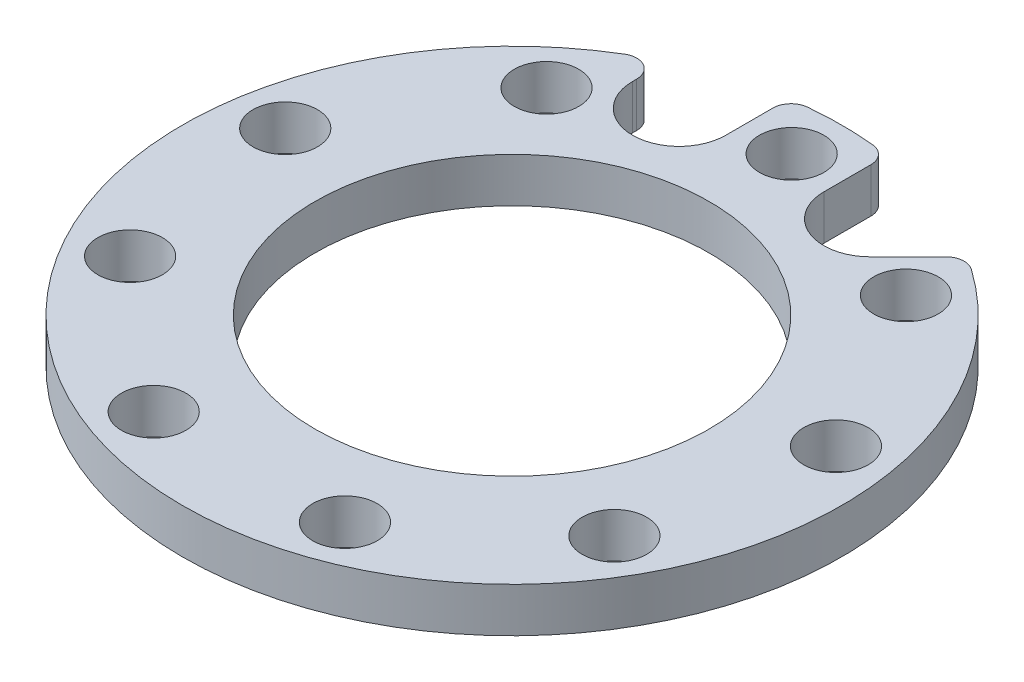
ISO-10303-21;
HEADER;
FILE_DESCRIPTION(('STEP AP214'),'2;1');
FILE_NAME('part.step','',(''),(''),'','','');
FILE_SCHEMA(('AUTOMOTIVE_DESIGN { 1 0 10303 214 1 1 1 1 }'));
ENDSEC;
DATA;
#1=APPLICATION_CONTEXT('core data for automotive mechanical design processes');
#2=APPLICATION_PROTOCOL_DEFINITION('international standard','automotive_design',2000,#1);
#3=PRODUCT_CONTEXT('',#1,'mechanical');
#4=PRODUCT('Part','Part','',(#3));
#5=PRODUCT_RELATED_PRODUCT_CATEGORY('part','',(#4));
#6=PRODUCT_DEFINITION_FORMATION('','',#4);
#7=PRODUCT_DEFINITION_CONTEXT('part definition',#1,'design');
#8=PRODUCT_DEFINITION('design','',#6,#7);
#9=PRODUCT_DEFINITION_SHAPE('','',#8);
#10=(LENGTH_UNIT() NAMED_UNIT(*) SI_UNIT(.MILLI.,.METRE.));
#11=(NAMED_UNIT(*) PLANE_ANGLE_UNIT() SI_UNIT($,.RADIAN.));
#12=(NAMED_UNIT(*) SI_UNIT($,.STERADIAN.) SOLID_ANGLE_UNIT());
#13=UNCERTAINTY_MEASURE_WITH_UNIT(LENGTH_MEASURE(1.E-05),#10,'distance_accuracy_value','');
#14=(GEOMETRIC_REPRESENTATION_CONTEXT(3) GLOBAL_UNCERTAINTY_ASSIGNED_CONTEXT((#13)) GLOBAL_UNIT_ASSIGNED_CONTEXT((#10,
#11,#12)) REPRESENTATION_CONTEXT('',''));
#15=CARTESIAN_POINT('',(0.,0.,0.));
#16=DIRECTION('',(0.,0.,1.));
#17=DIRECTION('',(1.,0.,0.));
#18=AXIS2_PLACEMENT_3D('',#15,#16,#17);
#19=CARTESIAN_POINT('',(0.,6.21400078,0.));
#20=DIRECTION('',(0.,-1.,0.));
#21=DIRECTION('',(0.,0.,-1.));
#22=AXIS2_PLACEMENT_3D('',#19,#20,#21);
#23=CYLINDRICAL_SURFACE('',#22,45.974);
#24=CARTESIAN_POINT('',(0.,6.21400078,0.));
#25=DIRECTION('',(0.,1.,0.));
#26=DIRECTION('',(0.,0.,1.));
#27=AXIS2_PLACEMENT_3D('',#24,#25,#26);
#28=CIRCLE('',#27,45.974);
#29=CARTESIAN_POINT('',(4.55017655985906,6.21400078,-45.7482739485777));
#30=VERTEX_POINT('',#29);
#31=CARTESIAN_POINT('',(-4.55017655985855,6.21400078,-45.7482739485777));
#32=VERTEX_POINT('',#31);
#33=EDGE_CURVE('E171',#30,#32,#28,.T.);
#34=ORIENTED_EDGE('',*,*,#33,.F.);
#35=DIRECTION('',(0.,-1.,0.));
#36=VECTOR('',#35,1.);
#37=CARTESIAN_POINT('',(4.55017655985906,6.21400078,-45.7482739485777));
#38=LINE('',#37,#36);
#39=CARTESIAN_POINT('',(4.55017655985906,0.,-45.7482739485777));
#40=VERTEX_POINT('',#39);
#41=EDGE_CURVE('E204',#30,#40,#38,.T.);
#42=ORIENTED_EDGE('',*,*,#41,.T.);
#43=CARTESIAN_POINT('',(0.,0.,0.));
#44=DIRECTION('',(0.,1.,0.));
#45=DIRECTION('',(0.,0.,1.));
#46=AXIS2_PLACEMENT_3D('',#43,#44,#45);
#47=CIRCLE('',#46,45.974);
#48=CARTESIAN_POINT('',(-4.55017655985855,0.,-45.7482739485777));
#49=VERTEX_POINT('',#48);
#50=EDGE_CURVE('E176',#40,#49,#47,.T.);
#51=ORIENTED_EDGE('',*,*,#50,.T.);
#52=DIRECTION('',(0.,-1.,0.));
#53=VECTOR('',#52,1.);
#54=CARTESIAN_POINT('',(-4.55017655985855,6.21400078,-45.7482739485777));
#55=LINE('',#54,#53);
#56=EDGE_CURVE('E201',#49,#32,#55,.F.);
#57=ORIENTED_EDGE('',*,*,#56,.T.);
#58=EDGE_LOOP('',(#34,#42,#51,#57));
#59=FACE_BOUND('',#58,.T.);
#60=ADVANCED_FACE('F34',(#59),#23,.T.);
#61=CARTESIAN_POINT('',(0.,6.21400078,0.));
#62=DIRECTION('',(0.,1.,0.));
#63=DIRECTION('',(0.,0.,1.));
#64=AXIS2_PLACEMENT_3D('',#61,#62,#63);
#65=PLANE('',#64);
#66=CARTESIAN_POINT('',(-23.687486501379,6.21400078,-39.401924562729));
#67=VERTEX_POINT('',#66);
#68=CARTESIAN_POINT('',(26.4576638960307,6.21400078,-37.5978815515539));
#69=VERTEX_POINT('',#68);
#70=EDGE_CURVE('E175',#67,#69,#28,.T.);
#71=ORIENTED_EDGE('',*,*,#70,.T.);
#72=CARTESIAN_POINT('',(24.9959145095096,6.21400078,-35.5206505266061));
#73=DIRECTION('',(0.,1.,0.));
#74=DIRECTION('',(0.,0.,1.));
#75=AXIS2_PLACEMENT_3D('',#72,#73,#74);
#76=CIRCLE('',#75,2.54);
#77=CARTESIAN_POINT('',(23.1998632852958,6.21400078,-37.31670175082));
#78=VERTEX_POINT('',#77);
#79=EDGE_CURVE('E189',#69,#78,#76,.T.);
#80=ORIENTED_EDGE('',*,*,#79,.T.);
#81=DIRECTION('',(0.707106781186547,0.,-0.707106781186548));
#82=VECTOR('',#81,1.);
#83=CARTESIAN_POINT('',(17.9349796674137,6.21400078,-32.0518181329379));
#84=LINE('',#83,#82);
#85=CARTESIAN_POINT('',(17.9349796674137,6.21400078,-32.0518181329379));
#86=VERTEX_POINT('',#85);
#87=EDGE_CURVE('E217',#86,#78,#84,.T.);
#88=ORIENTED_EDGE('',*,*,#87,.F.);
#89=CARTESIAN_POINT('',(13.3387855897011,6.21400078,-36.6480122106504));
#90=DIRECTION('',(0.,1.,0.));
#91=DIRECTION('',(0.,0.,1.));
#92=AXIS2_PLACEMENT_3D('',#89,#90,#91);
#93=CIRCLE('',#92,6.5);
#94=CARTESIAN_POINT('',(6.83878558970111,6.21400078,-36.6480122106504));
#95=VERTEX_POINT('',#94);
#96=EDGE_CURVE('E150',#95,#86,#93,.T.);
#97=ORIENTED_EDGE('',*,*,#96,.F.);
#98=DIRECTION('',(0.,0.,1.));
#99=VECTOR('',#98,1.);
#100=CARTESIAN_POINT('',(6.83878558970111,6.21400078,-36.6480122106504));
#101=LINE('',#100,#99);
#102=CARTESIAN_POINT('',(6.83878558970111,6.21400078,-43.2207450011424));
#103=VERTEX_POINT('',#102);
#104=EDGE_CURVE('E142',#103,#95,#101,.T.);
#105=ORIENTED_EDGE('',*,*,#104,.F.);
#106=CARTESIAN_POINT('',(4.2987855897011,6.21400078,-43.2207450011424));
#107=DIRECTION('',(0.,1.,0.));
#108=DIRECTION('',(0.,0.,1.));
#109=AXIS2_PLACEMENT_3D('',#106,#107,#108);
#110=CIRCLE('',#109,2.54);
#111=EDGE_CURVE('E187',#103,#30,#110,.T.);
#112=ORIENTED_EDGE('',*,*,#111,.T.);
#113=ORIENTED_EDGE('',*,*,#33,.T.);
#114=CARTESIAN_POINT('',(-4.29878558970062,6.21400078,-43.2207450011425));
#115=DIRECTION('',(0.,1.,0.));
#116=DIRECTION('',(0.,0.,1.));
#117=AXIS2_PLACEMENT_3D('',#114,#115,#116);
#118=CIRCLE('',#117,2.54);
#119=CARTESIAN_POINT('',(-6.83878558970062,6.21400078,-43.2207450011425));
#120=VERTEX_POINT('',#119);
#121=EDGE_CURVE('E185',#32,#120,#118,.T.);
#122=ORIENTED_EDGE('',*,*,#121,.T.);
#123=DIRECTION('',(0.,0.,-1.));
#124=VECTOR('',#123,1.);
#125=CARTESIAN_POINT('',(-6.83878558970062,6.21400078,-36.6480122106506));
#126=LINE('',#125,#124);
#127=CARTESIAN_POINT('',(-6.83878558970062,6.21400078,-36.6480122106506));
#128=VERTEX_POINT('',#127);
#129=EDGE_CURVE('E231',#128,#120,#126,.T.);
#130=ORIENTED_EDGE('',*,*,#129,.F.);
#131=CARTESIAN_POINT('',(-13.3387855897006,6.21400078,-36.6480122106506));
#132=DIRECTION('',(0.,1.,0.));
#133=DIRECTION('',(0.,0.,1.));
#134=AXIS2_PLACEMENT_3D('',#131,#132,#133);
#135=CIRCLE('',#134,6.5);
#136=CARTESIAN_POINT('',(-19.8387855897006,6.21400078,-36.6480122106506));
#137=VERTEX_POINT('',#136);
#138=EDGE_CURVE('E159',#137,#128,#135,.T.);
#139=ORIENTED_EDGE('',*,*,#138,.F.);
#140=DIRECTION('',(0.,0.,1.));
#141=VECTOR('',#140,1.);
#142=CARTESIAN_POINT('',(-19.8387855897006,6.21400078,-36.6480122106506));
#143=LINE('',#142,#141);
#144=CARTESIAN_POINT('',(-19.8387855897006,6.21400078,-37.225022653186));
#145=VERTEX_POINT('',#144);
#146=EDGE_CURVE('E228',#145,#137,#143,.T.);
#147=ORIENTED_EDGE('',*,*,#146,.F.);
#148=CARTESIAN_POINT('',(-22.3787855897006,6.21400078,-37.225022653186));
#149=DIRECTION('',(0.,1.,0.));
#150=DIRECTION('',(0.,0.,1.));
#151=AXIS2_PLACEMENT_3D('',#148,#149,#150);
#152=CIRCLE('',#151,2.54);
#153=EDGE_CURVE('E183',#145,#67,#152,.T.);
#154=ORIENTED_EDGE('',*,*,#153,.T.);
#155=EDGE_LOOP('',(#71,#80,#88,#97,#105,#112,#113,#122,#130,#139,#147,#154));
#156=FACE_BOUND('',#155,.T.);
#157=CARTESIAN_POINT('',(-25.0687167777747,6.21400078,-29.8757332816405));
#158=DIRECTION('',(0.,1.,0.));
#159=DIRECTION('',(0.,0.,1.));
#160=AXIS2_PLACEMENT_3D('',#157,#158,#159);
#161=CIRCLE('',#160,4.49999999999999);
#162=CARTESIAN_POINT('',(-25.0687167777747,6.21400078,-25.3757332816405));
#163=VERTEX_POINT('',#162);
#164=EDGE_CURVE('E146',#163,#163,#161,.T.);
#165=ORIENTED_EDGE('',*,*,#164,.F.);
#166=EDGE_LOOP('',(#165));
#167=FACE_BOUND('',#166,.T.);
#168=CARTESIAN_POINT('',(-38.407502367476,6.21400078,-6.77227892901068));
#169=DIRECTION('',(0.,1.,0.));
#170=DIRECTION('',(0.,0.,1.));
#171=AXIS2_PLACEMENT_3D('',#168,#169,#170);
#172=CIRCLE('',#171,4.49999999999999);
#173=CARTESIAN_POINT('',(-38.407502367476,6.21400078,-2.27227892901069));
#174=VERTEX_POINT('',#173);
#175=EDGE_CURVE('E242',#174,#174,#172,.T.);
#176=ORIENTED_EDGE('',*,*,#175,.F.);
#177=EDGE_LOOP('',(#176));
#178=FACE_BOUND('',#177,.T.);
#179=CARTESIAN_POINT('',(-33.7749907475933,6.21400078,19.4999999999997));
#180=DIRECTION('',(0.,1.,0.));
#181=DIRECTION('',(0.,0.,1.));
#182=AXIS2_PLACEMENT_3D('',#179,#180,#181);
#183=CIRCLE('',#182,4.49999999999999);
#184=CARTESIAN_POINT('',(-33.7749907475933,6.21400078,23.9999999999997));
#185=VERTEX_POINT('',#184);
#186=EDGE_CURVE('E248',#185,#185,#183,.T.);
#187=ORIENTED_EDGE('',*,*,#186,.F.);
#188=EDGE_LOOP('',(#187));
#189=FACE_BOUND('',#188,.T.);
#190=CARTESIAN_POINT('',(-13.3387855897014,6.21400078,36.6480122106503));
#191=DIRECTION('',(0.,1.,0.));
#192=DIRECTION('',(0.,0.,1.));
#193=AXIS2_PLACEMENT_3D('',#190,#191,#192);
#194=CIRCLE('',#193,4.49999999999999);
#195=CARTESIAN_POINT('',(-13.3387855897014,6.21400078,41.1480122106503));
#196=VERTEX_POINT('',#195);
#197=EDGE_CURVE('E254',#196,#196,#194,.T.);
#198=ORIENTED_EDGE('',*,*,#197,.F.);
#199=EDGE_LOOP('',(#198));
#200=FACE_BOUND('',#199,.T.);
#201=CARTESIAN_POINT('',(13.3387855897009,6.21400078,36.6480122106505));
#202=DIRECTION('',(0.,1.,0.));
#203=DIRECTION('',(0.,0.,1.));
#204=AXIS2_PLACEMENT_3D('',#201,#202,#203);
#205=CIRCLE('',#204,4.49999999999999);
#206=CARTESIAN_POINT('',(13.3387855897009,6.21400078,41.1480122106505));
#207=VERTEX_POINT('',#206);
#208=EDGE_CURVE('E260',#207,#207,#205,.T.);
#209=ORIENTED_EDGE('',*,*,#208,.F.);
#210=EDGE_LOOP('',(#209));
#211=FACE_BOUND('',#210,.T.);
#212=CARTESIAN_POINT('',(33.774990747593,6.21400078,19.5000000000002));
#213=DIRECTION('',(0.,1.,0.));
#214=DIRECTION('',(0.,0.,1.));
#215=AXIS2_PLACEMENT_3D('',#212,#213,#214);
#216=CIRCLE('',#215,4.49999999999999);
#217=CARTESIAN_POINT('',(33.774990747593,6.21400078,24.0000000000001));
#218=VERTEX_POINT('',#217);
#219=EDGE_CURVE('E266',#218,#218,#216,.T.);
#220=ORIENTED_EDGE('',*,*,#219,.F.);
#221=EDGE_LOOP('',(#220));
#222=FACE_BOUND('',#221,.T.);
#223=CARTESIAN_POINT('',(38.4075023674761,6.21400078,-6.77227892901017));
#224=DIRECTION('',(0.,1.,0.));
#225=DIRECTION('',(0.,0.,1.));
#226=AXIS2_PLACEMENT_3D('',#223,#224,#225);
#227=CIRCLE('',#226,4.49999999999999);
#228=CARTESIAN_POINT('',(38.4075023674761,6.21400078,-2.27227892901018));
#229=VERTEX_POINT('',#228);
#230=EDGE_CURVE('E272',#229,#229,#227,.T.);
#231=ORIENTED_EDGE('',*,*,#230,.F.);
#232=EDGE_LOOP('',(#231));
#233=FACE_BOUND('',#232,.T.);
#234=CARTESIAN_POINT('',(25.0687167777751,6.21400078,-29.8757332816401));
#235=DIRECTION('',(0.,1.,0.));
#236=DIRECTION('',(0.,0.,1.));
#237=AXIS2_PLACEMENT_3D('',#234,#235,#236);
#238=CIRCLE('',#237,4.49999999999999);
#239=CARTESIAN_POINT('',(25.0687167777751,6.21400078,-25.3757332816401));
#240=VERTEX_POINT('',#239);
#241=EDGE_CURVE('E278',#240,#240,#238,.T.);
#242=ORIENTED_EDGE('',*,*,#241,.F.);
#243=EDGE_LOOP('',(#242));
#244=FACE_BOUND('',#243,.T.);
#245=CARTESIAN_POINT('',(0.,6.21400078,-39.));
#246=DIRECTION('',(0.,1.,0.));
#247=DIRECTION('',(0.,0.,1.));
#248=AXIS2_PLACEMENT_3D('',#245,#246,#247);
#249=CIRCLE('',#248,4.49999999999999);
#250=CARTESIAN_POINT('',(0.,6.21400078,-34.5));
#251=VERTEX_POINT('',#250);
#252=EDGE_CURVE('E156',#251,#251,#249,.T.);
#253=ORIENTED_EDGE('',*,*,#252,.F.);
#254=EDGE_LOOP('',(#253));
#255=FACE_BOUND('',#254,.T.);
#256=CARTESIAN_POINT('',(0.,6.21400078,0.));
#257=DIRECTION('',(0.,1.,0.));
#258=DIRECTION('',(0.,0.,1.));
#259=AXIS2_PLACEMENT_3D('',#256,#257,#258);
#260=CIRCLE('',#259,27.4955);
#261=CARTESIAN_POINT('',(0.,6.21400078,27.4955));
#262=VERTEX_POINT('',#261);
#263=EDGE_CURVE('E165',#262,#262,#260,.T.);
#264=ORIENTED_EDGE('',*,*,#263,.F.);
#265=EDGE_LOOP('',(#264));
#266=FACE_BOUND('',#265,.T.);
#267=ADVANCED_FACE('F214',(#156,#167,#178,#189,#200,#211,#222,#233,#244,#255,#266),#65,.T.);
#268=CARTESIAN_POINT('',(0.,0.,0.));
#269=DIRECTION('',(0.,1.,0.));
#270=DIRECTION('',(0.,0.,1.));
#271=AXIS2_PLACEMENT_3D('',#268,#269,#270);
#272=PLANE('',#271);
#273=CARTESIAN_POINT('',(-25.0687167777747,0.,-29.8757332816405));
#274=DIRECTION('',(0.,1.,0.));
#275=DIRECTION('',(0.,0.,1.));
#276=AXIS2_PLACEMENT_3D('',#273,#274,#275);
#277=CIRCLE('',#276,4.5);
#278=CARTESIAN_POINT('',(-25.0687167777747,0.,-25.3757332816405));
#279=VERTEX_POINT('',#278);
#280=EDGE_CURVE('E239',#279,#279,#277,.T.);
#281=ORIENTED_EDGE('',*,*,#280,.T.);
#282=EDGE_LOOP('',(#281));
#283=FACE_BOUND('',#282,.T.);
#284=CARTESIAN_POINT('',(-38.407502367476,0.,-6.77227892901068));
#285=DIRECTION('',(0.,1.,0.));
#286=DIRECTION('',(0.,0.,1.));
#287=AXIS2_PLACEMENT_3D('',#284,#285,#286);
#288=CIRCLE('',#287,4.5);
#289=CARTESIAN_POINT('',(-38.407502367476,0.,-2.27227892901068));
#290=VERTEX_POINT('',#289);
#291=EDGE_CURVE('E245',#290,#290,#288,.T.);
#292=ORIENTED_EDGE('',*,*,#291,.T.);
#293=EDGE_LOOP('',(#292));
#294=FACE_BOUND('',#293,.T.);
#295=CARTESIAN_POINT('',(-33.7749907475933,0.,19.4999999999997));
#296=DIRECTION('',(0.,1.,0.));
#297=DIRECTION('',(0.,0.,1.));
#298=AXIS2_PLACEMENT_3D('',#295,#296,#297);
#299=CIRCLE('',#298,4.5);
#300=CARTESIAN_POINT('',(-33.7749907475933,0.,23.9999999999997));
#301=VERTEX_POINT('',#300);
#302=EDGE_CURVE('E251',#301,#301,#299,.T.);
#303=ORIENTED_EDGE('',*,*,#302,.T.);
#304=EDGE_LOOP('',(#303));
#305=FACE_BOUND('',#304,.T.);
#306=CARTESIAN_POINT('',(-13.3387855897014,0.,36.6480122106503));
#307=DIRECTION('',(0.,1.,0.));
#308=DIRECTION('',(0.,0.,1.));
#309=AXIS2_PLACEMENT_3D('',#306,#307,#308);
#310=CIRCLE('',#309,4.5);
#311=CARTESIAN_POINT('',(-13.3387855897014,0.,41.1480122106503));
#312=VERTEX_POINT('',#311);
#313=EDGE_CURVE('E257',#312,#312,#310,.T.);
#314=ORIENTED_EDGE('',*,*,#313,.T.);
#315=EDGE_LOOP('',(#314));
#316=FACE_BOUND('',#315,.T.);
#317=CARTESIAN_POINT('',(13.3387855897009,0.,36.6480122106505));
#318=DIRECTION('',(0.,1.,0.));
#319=DIRECTION('',(0.,0.,1.));
#320=AXIS2_PLACEMENT_3D('',#317,#318,#319);
#321=CIRCLE('',#320,4.5);
#322=CARTESIAN_POINT('',(13.3387855897009,0.,41.1480122106505));
#323=VERTEX_POINT('',#322);
#324=EDGE_CURVE('E263',#323,#323,#321,.T.);
#325=ORIENTED_EDGE('',*,*,#324,.T.);
#326=EDGE_LOOP('',(#325));
#327=FACE_BOUND('',#326,.T.);
#328=CARTESIAN_POINT('',(33.774990747593,0.,19.5000000000002));
#329=DIRECTION('',(0.,1.,0.));
#330=DIRECTION('',(0.,0.,1.));
#331=AXIS2_PLACEMENT_3D('',#328,#329,#330);
#332=CIRCLE('',#331,4.5);
#333=CARTESIAN_POINT('',(33.774990747593,0.,24.0000000000002));
#334=VERTEX_POINT('',#333);
#335=EDGE_CURVE('E269',#334,#334,#332,.T.);
#336=ORIENTED_EDGE('',*,*,#335,.T.);
#337=EDGE_LOOP('',(#336));
#338=FACE_BOUND('',#337,.T.);
#339=CARTESIAN_POINT('',(38.4075023674761,0.,-6.77227892901017));
#340=DIRECTION('',(0.,1.,0.));
#341=DIRECTION('',(0.,0.,1.));
#342=AXIS2_PLACEMENT_3D('',#339,#340,#341);
#343=CIRCLE('',#342,4.5);
#344=CARTESIAN_POINT('',(38.4075023674761,0.,-2.27227892901017));
#345=VERTEX_POINT('',#344);
#346=EDGE_CURVE('E275',#345,#345,#343,.T.);
#347=ORIENTED_EDGE('',*,*,#346,.T.);
#348=EDGE_LOOP('',(#347));
#349=FACE_BOUND('',#348,.T.);
#350=CARTESIAN_POINT('',(25.0687167777751,0.,-29.8757332816401));
#351=DIRECTION('',(0.,1.,0.));
#352=DIRECTION('',(0.,0.,1.));
#353=AXIS2_PLACEMENT_3D('',#350,#351,#352);
#354=CIRCLE('',#353,4.5);
#355=CARTESIAN_POINT('',(25.0687167777751,0.,-25.3757332816401));
#356=VERTEX_POINT('',#355);
#357=EDGE_CURVE('E281',#356,#356,#354,.T.);
#358=ORIENTED_EDGE('',*,*,#357,.T.);
#359=EDGE_LOOP('',(#358));
#360=FACE_BOUND('',#359,.T.);
#361=CARTESIAN_POINT('',(0.,0.,-39.));
#362=DIRECTION('',(0.,1.,0.));
#363=DIRECTION('',(0.,0.,1.));
#364=AXIS2_PLACEMENT_3D('',#361,#362,#363);
#365=CIRCLE('',#364,4.5);
#366=CARTESIAN_POINT('',(0.,0.,-34.5));
#367=VERTEX_POINT('',#366);
#368=EDGE_CURVE('E151',#367,#367,#365,.T.);
#369=ORIENTED_EDGE('',*,*,#368,.T.);
#370=EDGE_LOOP('',(#369));
#371=FACE_BOUND('',#370,.T.);
#372=CARTESIAN_POINT('',(0.,0.,0.));
#373=DIRECTION('',(0.,1.,0.));
#374=DIRECTION('',(0.,0.,1.));
#375=AXIS2_PLACEMENT_3D('',#372,#373,#374);
#376=CIRCLE('',#375,27.4955);
#377=CARTESIAN_POINT('',(0.,0.,27.4955));
#378=VERTEX_POINT('',#377);
#379=EDGE_CURVE('E162',#378,#378,#376,.T.);
#380=ORIENTED_EDGE('',*,*,#379,.T.);
#381=EDGE_LOOP('',(#380));
#382=FACE_BOUND('',#381,.T.);
#383=DIRECTION('',(0.707106781186547,0.,-0.707106781186548));
#384=VECTOR('',#383,1.);
#385=CARTESIAN_POINT('',(17.9349796674137,0.,-32.0518181329379));
#386=LINE('',#385,#384);
#387=CARTESIAN_POINT('',(17.9349796674137,0.,-32.0518181329379));
#388=VERTEX_POINT('',#387);
#389=CARTESIAN_POINT('',(23.1998632852958,0.,-37.31670175082));
#390=VERTEX_POINT('',#389);
#391=EDGE_CURVE('E136',#388,#390,#386,.T.);
#392=ORIENTED_EDGE('',*,*,#391,.T.);
#393=CARTESIAN_POINT('',(24.9959145095096,0.,-35.5206505266061));
#394=DIRECTION('',(0.,1.,0.));
#395=DIRECTION('',(0.,0.,1.));
#396=AXIS2_PLACEMENT_3D('',#393,#394,#395);
#397=CIRCLE('',#396,2.54);
#398=CARTESIAN_POINT('',(26.4576638960307,0.,-37.5978815515539));
#399=VERTEX_POINT('',#398);
#400=EDGE_CURVE('E197',#390,#399,#397,.F.);
#401=ORIENTED_EDGE('',*,*,#400,.T.);
#402=CARTESIAN_POINT('',(-23.687486501379,0.,-39.401924562729));
#403=VERTEX_POINT('',#402);
#404=EDGE_CURVE('E168',#403,#399,#47,.T.);
#405=ORIENTED_EDGE('',*,*,#404,.F.);
#406=CARTESIAN_POINT('',(-22.3787855897006,0.,-37.225022653186));
#407=DIRECTION('',(0.,1.,0.));
#408=DIRECTION('',(0.,0.,1.));
#409=AXIS2_PLACEMENT_3D('',#406,#407,#408);
#410=CIRCLE('',#409,2.54);
#411=CARTESIAN_POINT('',(-19.8387855897006,0.,-37.225022653186));
#412=VERTEX_POINT('',#411);
#413=EDGE_CURVE('E56',#403,#412,#410,.F.);
#414=ORIENTED_EDGE('',*,*,#413,.T.);
#415=DIRECTION('',(0.,0.,1.));
#416=VECTOR('',#415,1.);
#417=CARTESIAN_POINT('',(-19.8387855897006,0.,-36.6480122106506));
#418=LINE('',#417,#416);
#419=CARTESIAN_POINT('',(-19.8387855897006,0.,-36.6480122106506));
#420=VERTEX_POINT('',#419);
#421=EDGE_CURVE('E227',#412,#420,#418,.T.);
#422=ORIENTED_EDGE('',*,*,#421,.T.);
#423=CARTESIAN_POINT('',(-13.3387855897006,0.,-36.6480122106506));
#424=DIRECTION('',(0.,1.,0.));
#425=DIRECTION('',(0.,0.,1.));
#426=AXIS2_PLACEMENT_3D('',#423,#424,#425);
#427=CIRCLE('',#426,6.5);
#428=CARTESIAN_POINT('',(-6.83878558970062,0.,-36.6480122106506));
#429=VERTEX_POINT('',#428);
#430=EDGE_CURVE('E153',#420,#429,#427,.T.);
#431=ORIENTED_EDGE('',*,*,#430,.T.);
#432=DIRECTION('',(0.,0.,-1.));
#433=VECTOR('',#432,1.);
#434=CARTESIAN_POINT('',(-6.83878558970062,0.,-36.6480122106506));
#435=LINE('',#434,#433);
#436=CARTESIAN_POINT('',(-6.83878558970062,0.,-43.2207450011425));
#437=VERTEX_POINT('',#436);
#438=EDGE_CURVE('E225',#429,#437,#435,.T.);
#439=ORIENTED_EDGE('',*,*,#438,.T.);
#440=CARTESIAN_POINT('',(-4.29878558970062,0.,-43.2207450011425));
#441=DIRECTION('',(0.,1.,0.));
#442=DIRECTION('',(0.,0.,1.));
#443=AXIS2_PLACEMENT_3D('',#440,#441,#442);
#444=CIRCLE('',#443,2.54);
#445=EDGE_CURVE('E194',#437,#49,#444,.F.);
#446=ORIENTED_EDGE('',*,*,#445,.T.);
#447=ORIENTED_EDGE('',*,*,#50,.F.);
#448=CARTESIAN_POINT('',(4.2987855897011,0.,-43.2207450011424));
#449=DIRECTION('',(0.,1.,0.));
#450=DIRECTION('',(0.,0.,1.));
#451=AXIS2_PLACEMENT_3D('',#448,#449,#450);
#452=CIRCLE('',#451,2.54);
#453=CARTESIAN_POINT('',(6.83878558970111,0.,-43.2207450011424));
#454=VERTEX_POINT('',#453);
#455=EDGE_CURVE('E131',#40,#454,#452,.F.);
#456=ORIENTED_EDGE('',*,*,#455,.T.);
#457=DIRECTION('',(0.,0.,1.));
#458=VECTOR('',#457,1.);
#459=CARTESIAN_POINT('',(6.83878558970111,0.,-36.6480122106504));
#460=LINE('',#459,#458);
#461=CARTESIAN_POINT('',(6.83878558970111,0.,-36.6480122106504));
#462=VERTEX_POINT('',#461);
#463=EDGE_CURVE('E123',#454,#462,#460,.T.);
#464=ORIENTED_EDGE('',*,*,#463,.T.);
#465=CARTESIAN_POINT('',(13.3387855897011,0.,-36.6480122106504));
#466=DIRECTION('',(0.,1.,0.));
#467=DIRECTION('',(0.,0.,1.));
#468=AXIS2_PLACEMENT_3D('',#465,#466,#467);
#469=CIRCLE('',#468,6.5);
#470=EDGE_CURVE('E128',#462,#388,#469,.T.);
#471=ORIENTED_EDGE('',*,*,#470,.T.);
#472=EDGE_LOOP('',(#392,#401,#405,#414,#422,#431,#439,#446,#447,#456,#464,#471));
#473=FACE_BOUND('',#472,.T.);
#474=ADVANCED_FACE('F126',(#283,#294,#305,#316,#327,#338,#349,#360,#371,#382,#473),#272,.F.);
#475=ORIENTED_EDGE('',*,*,#404,.T.);
#476=DIRECTION('',(0.,-1.,0.));
#477=VECTOR('',#476,1.);
#478=CARTESIAN_POINT('',(26.4576638960307,6.21400078,-37.5978815515539));
#479=LINE('',#478,#477);
#480=EDGE_CURVE('E180',#399,#69,#479,.F.);
#481=ORIENTED_EDGE('',*,*,#480,.T.);
#482=ORIENTED_EDGE('',*,*,#70,.F.);
#483=DIRECTION('',(0.,-1.,0.));
#484=VECTOR('',#483,1.);
#485=CARTESIAN_POINT('',(-23.687486501379,6.21400078,-39.401924562729));
#486=LINE('',#485,#484);
#487=EDGE_CURVE('E174',#67,#403,#486,.T.);
#488=ORIENTED_EDGE('',*,*,#487,.T.);
#489=EDGE_LOOP('',(#475,#481,#482,#488));
#490=FACE_BOUND('',#489,.T.);
#491=ADVANCED_FACE('F298',(#490),#23,.T.);
#492=CARTESIAN_POINT('',(0.,6.21400078,0.));
#493=DIRECTION('',(0.,-1.,0.));
#494=DIRECTION('',(0.,0.,-1.));
#495=AXIS2_PLACEMENT_3D('',#492,#493,#494);
#496=CYLINDRICAL_SURFACE('',#495,27.4955);
#497=ORIENTED_EDGE('',*,*,#263,.T.);
#498=EDGE_LOOP('',(#497));
#499=FACE_BOUND('',#498,.T.);
#500=ORIENTED_EDGE('',*,*,#379,.F.);
#501=EDGE_LOOP('',(#500));
#502=FACE_BOUND('',#501,.T.);
#503=ADVANCED_FACE('F294',(#499,#502),#496,.F.);
#504=CARTESIAN_POINT('',(-13.3387855897006,6.21400078,-36.6480122106506));
#505=DIRECTION('',(0.,-1.,0.));
#506=DIRECTION('',(0.,0.,-1.));
#507=AXIS2_PLACEMENT_3D('',#504,#505,#506);
#508=CYLINDRICAL_SURFACE('',#507,6.5);
#509=DIRECTION('',(0.,1.,0.));
#510=VECTOR('',#509,1.);
#511=CARTESIAN_POINT('',(-19.8387855897006,0.,-36.6480122106506));
#512=LINE('',#511,#510);
#513=EDGE_CURVE('E221',#420,#137,#512,.T.);
#514=ORIENTED_EDGE('',*,*,#513,.T.);
#515=ORIENTED_EDGE('',*,*,#138,.T.);
#516=DIRECTION('',(0.,1.,0.));
#517=VECTOR('',#516,1.);
#518=CARTESIAN_POINT('',(-6.83878558970062,0.,-36.6480122106506));
#519=LINE('',#518,#517);
#520=EDGE_CURVE('E230',#429,#128,#519,.T.);
#521=ORIENTED_EDGE('',*,*,#520,.F.);
#522=ORIENTED_EDGE('',*,*,#430,.F.);
#523=EDGE_LOOP('',(#514,#515,#521,#522));
#524=FACE_BOUND('',#523,.T.);
#525=ADVANCED_FACE('F297',(#524),#508,.F.);
#526=CARTESIAN_POINT('',(13.3387855897011,6.21400078,-36.6480122106504));
#527=DIRECTION('',(0.,-1.,0.));
#528=DIRECTION('',(0.,0.,-1.));
#529=AXIS2_PLACEMENT_3D('',#526,#527,#528);
#530=CYLINDRICAL_SURFACE('',#529,6.5);
#531=DIRECTION('',(0.,1.,0.));
#532=VECTOR('',#531,1.);
#533=CARTESIAN_POINT('',(6.83878558970111,0.,-36.6480122106504));
#534=LINE('',#533,#532);
#535=EDGE_CURVE('E139',#462,#95,#534,.T.);
#536=ORIENTED_EDGE('',*,*,#535,.T.);
#537=ORIENTED_EDGE('',*,*,#96,.T.);
#538=DIRECTION('',(0.,1.,0.));
#539=VECTOR('',#538,1.);
#540=CARTESIAN_POINT('',(17.9349796674137,0.,-32.0518181329379));
#541=LINE('',#540,#539);
#542=EDGE_CURVE('E135',#388,#86,#541,.T.);
#543=ORIENTED_EDGE('',*,*,#542,.F.);
#544=ORIENTED_EDGE('',*,*,#470,.F.);
#545=EDGE_LOOP('',(#536,#537,#543,#544));
#546=FACE_BOUND('',#545,.T.);
#547=ADVANCED_FACE('F149',(#546),#530,.F.);
#548=CARTESIAN_POINT('',(0.,6.21400078,-39.));
#549=DIRECTION('',(0.,1.,0.));
#550=DIRECTION('',(0.,0.,1.));
#551=AXIS2_PLACEMENT_3D('',#548,#549,#550);
#552=CYLINDRICAL_SURFACE('',#551,4.49999999999999);
#553=ORIENTED_EDGE('',*,*,#368,.F.);
#554=EDGE_LOOP('',(#553));
#555=FACE_BOUND('',#554,.T.);
#556=ORIENTED_EDGE('',*,*,#252,.T.);
#557=EDGE_LOOP('',(#556));
#558=FACE_BOUND('',#557,.T.);
#559=ADVANCED_FACE('F287',(#555,#558),#552,.F.);
#560=CARTESIAN_POINT('',(25.0687167777751,6.21400078,-29.8757332816401));
#561=DIRECTION('',(0.,1.,0.));
#562=DIRECTION('',(0.,0.,1.));
#563=AXIS2_PLACEMENT_3D('',#560,#561,#562);
#564=CYLINDRICAL_SURFACE('',#563,4.49999999999999);
#565=ORIENTED_EDGE('',*,*,#357,.F.);
#566=EDGE_LOOP('',(#565));
#567=FACE_BOUND('',#566,.T.);
#568=ORIENTED_EDGE('',*,*,#241,.T.);
#569=EDGE_LOOP('',(#568));
#570=FACE_BOUND('',#569,.T.);
#571=ADVANCED_FACE('F384',(#567,#570),#564,.F.);
#572=CARTESIAN_POINT('',(38.4075023674761,6.21400078,-6.77227892901017));
#573=DIRECTION('',(0.,1.,0.));
#574=DIRECTION('',(0.,0.,1.));
#575=AXIS2_PLACEMENT_3D('',#572,#573,#574);
#576=CYLINDRICAL_SURFACE('',#575,4.49999999999999);
#577=ORIENTED_EDGE('',*,*,#346,.F.);
#578=EDGE_LOOP('',(#577));
#579=FACE_BOUND('',#578,.T.);
#580=ORIENTED_EDGE('',*,*,#230,.T.);
#581=EDGE_LOOP('',(#580));
#582=FACE_BOUND('',#581,.T.);
#583=ADVANCED_FACE('F380',(#579,#582),#576,.F.);
#584=CARTESIAN_POINT('',(33.774990747593,6.21400078,19.5000000000002));
#585=DIRECTION('',(0.,1.,0.));
#586=DIRECTION('',(0.,0.,1.));
#587=AXIS2_PLACEMENT_3D('',#584,#585,#586);
#588=CYLINDRICAL_SURFACE('',#587,4.49999999999999);
#589=ORIENTED_EDGE('',*,*,#335,.F.);
#590=EDGE_LOOP('',(#589));
#591=FACE_BOUND('',#590,.T.);
#592=ORIENTED_EDGE('',*,*,#219,.T.);
#593=EDGE_LOOP('',(#592));
#594=FACE_BOUND('',#593,.T.);
#595=ADVANCED_FACE('F376',(#591,#594),#588,.F.);
#596=CARTESIAN_POINT('',(13.3387855897009,6.21400078,36.6480122106505));
#597=DIRECTION('',(0.,1.,0.));
#598=DIRECTION('',(0.,0.,1.));
#599=AXIS2_PLACEMENT_3D('',#596,#597,#598);
#600=CYLINDRICAL_SURFACE('',#599,4.49999999999999);
#601=ORIENTED_EDGE('',*,*,#324,.F.);
#602=EDGE_LOOP('',(#601));
#603=FACE_BOUND('',#602,.T.);
#604=ORIENTED_EDGE('',*,*,#208,.T.);
#605=EDGE_LOOP('',(#604));
#606=FACE_BOUND('',#605,.T.);
#607=ADVANCED_FACE('F372',(#603,#606),#600,.F.);
#608=CARTESIAN_POINT('',(-13.3387855897014,6.21400078,36.6480122106503));
#609=DIRECTION('',(0.,1.,0.));
#610=DIRECTION('',(0.,0.,1.));
#611=AXIS2_PLACEMENT_3D('',#608,#609,#610);
#612=CYLINDRICAL_SURFACE('',#611,4.49999999999999);
#613=ORIENTED_EDGE('',*,*,#313,.F.);
#614=EDGE_LOOP('',(#613));
#615=FACE_BOUND('',#614,.T.);
#616=ORIENTED_EDGE('',*,*,#197,.T.);
#617=EDGE_LOOP('',(#616));
#618=FACE_BOUND('',#617,.T.);
#619=ADVANCED_FACE('F368',(#615,#618),#612,.F.);
#620=CARTESIAN_POINT('',(-33.7749907475933,6.21400078,19.4999999999997));
#621=DIRECTION('',(0.,1.,0.));
#622=DIRECTION('',(0.,0.,1.));
#623=AXIS2_PLACEMENT_3D('',#620,#621,#622);
#624=CYLINDRICAL_SURFACE('',#623,4.49999999999999);
#625=ORIENTED_EDGE('',*,*,#302,.F.);
#626=EDGE_LOOP('',(#625));
#627=FACE_BOUND('',#626,.T.);
#628=ORIENTED_EDGE('',*,*,#186,.T.);
#629=EDGE_LOOP('',(#628));
#630=FACE_BOUND('',#629,.T.);
#631=ADVANCED_FACE('F364',(#627,#630),#624,.F.);
#632=CARTESIAN_POINT('',(-38.407502367476,6.21400078,-6.77227892901068));
#633=DIRECTION('',(0.,1.,0.));
#634=DIRECTION('',(0.,0.,1.));
#635=AXIS2_PLACEMENT_3D('',#632,#633,#634);
#636=CYLINDRICAL_SURFACE('',#635,4.49999999999999);
#637=ORIENTED_EDGE('',*,*,#291,.F.);
#638=EDGE_LOOP('',(#637));
#639=FACE_BOUND('',#638,.T.);
#640=ORIENTED_EDGE('',*,*,#175,.T.);
#641=EDGE_LOOP('',(#640));
#642=FACE_BOUND('',#641,.T.);
#643=ADVANCED_FACE('F354',(#639,#642),#636,.F.);
#644=CARTESIAN_POINT('',(-25.0687167777747,6.21400078,-29.8757332816405));
#645=DIRECTION('',(0.,1.,0.));
#646=DIRECTION('',(0.,0.,1.));
#647=AXIS2_PLACEMENT_3D('',#644,#645,#646);
#648=CYLINDRICAL_SURFACE('',#647,4.49999999999999);
#649=ORIENTED_EDGE('',*,*,#280,.F.);
#650=EDGE_LOOP('',(#649));
#651=FACE_BOUND('',#650,.T.);
#652=ORIENTED_EDGE('',*,*,#164,.T.);
#653=EDGE_LOOP('',(#652));
#654=FACE_BOUND('',#653,.T.);
#655=ADVANCED_FACE('F347',(#651,#654),#648,.F.);
#656=CARTESIAN_POINT('',(17.9349796674137,0.,-32.0518181329379));
#657=DIRECTION('',(0.707106781186548,0.,0.707106781186547));
#658=DIRECTION('',(0.707106781186547,0.,-0.707106781186548));
#659=AXIS2_PLACEMENT_3D('',#656,#657,#658);
#660=PLANE('',#659);
#661=ORIENTED_EDGE('',*,*,#87,.T.);
#662=DIRECTION('',(0.,-1.,0.));
#663=VECTOR('',#662,1.);
#664=CARTESIAN_POINT('',(23.1998632852958,0.,-37.31670175082));
#665=LINE('',#664,#663);
#666=EDGE_CURVE('E191',#78,#390,#665,.T.);
#667=ORIENTED_EDGE('',*,*,#666,.T.);
#668=ORIENTED_EDGE('',*,*,#391,.F.);
#669=ORIENTED_EDGE('',*,*,#542,.T.);
#670=EDGE_LOOP('',(#661,#667,#668,#669));
#671=FACE_BOUND('',#670,.T.);
#672=ADVANCED_FACE('F345',(#671),#660,.F.);
#673=CARTESIAN_POINT('',(6.83878558970111,0.,-36.6480122106504));
#674=DIRECTION('',(-1.,0.,0.));
#675=DIRECTION('',(0.,0.,1.));
#676=AXIS2_PLACEMENT_3D('',#673,#674,#675);
#677=PLANE('',#676);
#678=ORIENTED_EDGE('',*,*,#463,.F.);
#679=DIRECTION('',(0.,-1.,0.));
#680=VECTOR('',#679,1.);
#681=CARTESIAN_POINT('',(6.83878558970111,0.,-43.2207450011424));
#682=LINE('',#681,#680);
#683=EDGE_CURVE('E199',#454,#103,#682,.F.);
#684=ORIENTED_EDGE('',*,*,#683,.T.);
#685=ORIENTED_EDGE('',*,*,#104,.T.);
#686=ORIENTED_EDGE('',*,*,#535,.F.);
#687=EDGE_LOOP('',(#678,#684,#685,#686));
#688=FACE_BOUND('',#687,.T.);
#689=ADVANCED_FACE('F140',(#688),#677,.F.);
#690=CARTESIAN_POINT('',(-6.83878558970062,0.,-36.6480122106506));
#691=DIRECTION('',(1.,0.,0.));
#692=DIRECTION('',(0.,0.,-1.));
#693=AXIS2_PLACEMENT_3D('',#690,#691,#692);
#694=PLANE('',#693);
#695=ORIENTED_EDGE('',*,*,#129,.T.);
#696=DIRECTION('',(0.,-1.,0.));
#697=VECTOR('',#696,1.);
#698=CARTESIAN_POINT('',(-6.83878558970062,0.,-43.2207450011425));
#699=LINE('',#698,#697);
#700=EDGE_CURVE('E42',#120,#437,#699,.T.);
#701=ORIENTED_EDGE('',*,*,#700,.T.);
#702=ORIENTED_EDGE('',*,*,#438,.F.);
#703=ORIENTED_EDGE('',*,*,#520,.T.);
#704=EDGE_LOOP('',(#695,#701,#702,#703));
#705=FACE_BOUND('',#704,.T.);
#706=ADVANCED_FACE('F330',(#705),#694,.F.);
#707=CARTESIAN_POINT('',(-19.8387855897006,0.,-36.6480122106506));
#708=DIRECTION('',(-1.,0.,0.));
#709=DIRECTION('',(0.,0.,1.));
#710=AXIS2_PLACEMENT_3D('',#707,#708,#709);
#711=PLANE('',#710);
#712=ORIENTED_EDGE('',*,*,#421,.F.);
#713=DIRECTION('',(0.,-1.,0.));
#714=VECTOR('',#713,1.);
#715=CARTESIAN_POINT('',(-19.8387855897006,0.,-37.225022653186));
#716=LINE('',#715,#714);
#717=EDGE_CURVE('E11',#412,#145,#716,.F.);
#718=ORIENTED_EDGE('',*,*,#717,.T.);
#719=ORIENTED_EDGE('',*,*,#146,.T.);
#720=ORIENTED_EDGE('',*,*,#513,.F.);
#721=EDGE_LOOP('',(#712,#718,#719,#720));
#722=FACE_BOUND('',#721,.T.);
#723=ADVANCED_FACE('F318',(#722),#711,.F.);
#724=CARTESIAN_POINT('',(24.9959145095096,6.21400078,-35.5206505266061));
#725=DIRECTION('',(0.,-1.,0.));
#726=DIRECTION('',(0.,0.,-1.));
#727=AXIS2_PLACEMENT_3D('',#724,#725,#726);
#728=CYLINDRICAL_SURFACE('',#727,2.54);
#729=ORIENTED_EDGE('',*,*,#400,.F.);
#730=ORIENTED_EDGE('',*,*,#666,.F.);
#731=ORIENTED_EDGE('',*,*,#79,.F.);
#732=ORIENTED_EDGE('',*,*,#480,.F.);
#733=EDGE_LOOP('',(#729,#730,#731,#732));
#734=FACE_BOUND('',#733,.T.);
#735=ADVANCED_FACE('F315',(#734),#728,.T.);
#736=CARTESIAN_POINT('',(4.2987855897011,6.21400078,-43.2207450011424));
#737=DIRECTION('',(0.,-1.,0.));
#738=DIRECTION('',(0.,0.,-1.));
#739=AXIS2_PLACEMENT_3D('',#736,#737,#738);
#740=CYLINDRICAL_SURFACE('',#739,2.54);
#741=ORIENTED_EDGE('',*,*,#455,.F.);
#742=ORIENTED_EDGE('',*,*,#41,.F.);
#743=ORIENTED_EDGE('',*,*,#111,.F.);
#744=ORIENTED_EDGE('',*,*,#683,.F.);
#745=EDGE_LOOP('',(#741,#742,#743,#744));
#746=FACE_BOUND('',#745,.T.);
#747=ADVANCED_FACE('F211',(#746),#740,.T.);
#748=CARTESIAN_POINT('',(-4.29878558970062,6.21400078,-43.2207450011425));
#749=DIRECTION('',(0.,-1.,0.));
#750=DIRECTION('',(0.,0.,-1.));
#751=AXIS2_PLACEMENT_3D('',#748,#749,#750);
#752=CYLINDRICAL_SURFACE('',#751,2.54);
#753=ORIENTED_EDGE('',*,*,#445,.F.);
#754=ORIENTED_EDGE('',*,*,#700,.F.);
#755=ORIENTED_EDGE('',*,*,#121,.F.);
#756=ORIENTED_EDGE('',*,*,#56,.F.);
#757=EDGE_LOOP('',(#753,#754,#755,#756));
#758=FACE_BOUND('',#757,.T.);
#759=ADVANCED_FACE('F321',(#758),#752,.T.);
#760=CARTESIAN_POINT('',(-22.3787855897006,6.21400078,-37.225022653186));
#761=DIRECTION('',(0.,-1.,0.));
#762=DIRECTION('',(0.,0.,-1.));
#763=AXIS2_PLACEMENT_3D('',#760,#761,#762);
#764=CYLINDRICAL_SURFACE('',#763,2.54);
#765=ORIENTED_EDGE('',*,*,#413,.F.);
#766=ORIENTED_EDGE('',*,*,#487,.F.);
#767=ORIENTED_EDGE('',*,*,#153,.F.);
#768=ORIENTED_EDGE('',*,*,#717,.F.);
#769=EDGE_LOOP('',(#765,#766,#767,#768));
#770=FACE_BOUND('',#769,.T.);
#771=ADVANCED_FACE('F36',(#770),#764,.T.);
#772=CLOSED_SHELL('',(#60,#267,#474,#491,#503,#525,#547,#559,#571,#583,#595,#607,#619,#631,#643,
#655,#672,#689,#706,#723,#735,#747,#759,#771));
#773=MANIFOLD_SOLID_BREP('B2',#772);
#774=ADVANCED_BREP_SHAPE_REPRESENTATION('',(#18,#773),#14);
#775=SHAPE_DEFINITION_REPRESENTATION(#9,#774);
ENDSEC;
END-ISO-10303-21;
